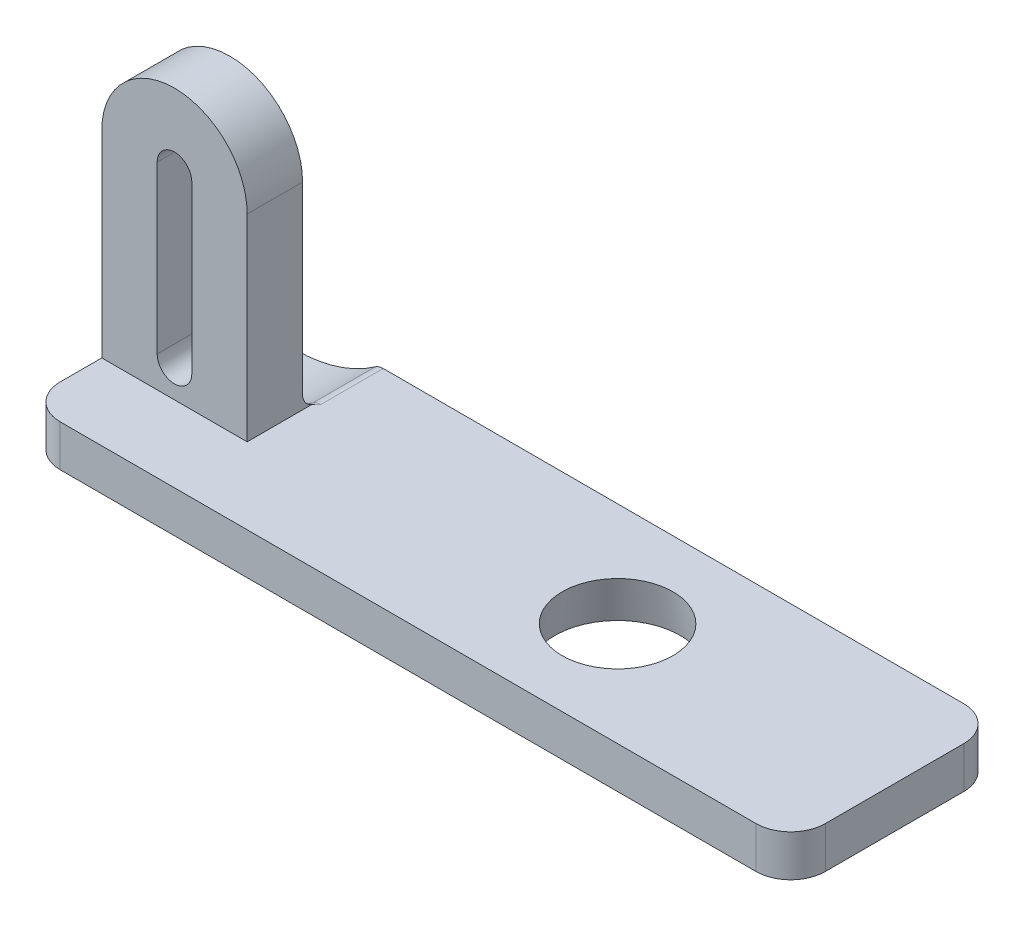
ISO-10303-21;
HEADER;
FILE_DESCRIPTION(('STEP AP214'),'2;1');
FILE_NAME('part.step','',(''),(''),'','','');
FILE_SCHEMA(('AUTOMOTIVE_DESIGN { 1 0 10303 214 1 1 1 1 }'));
ENDSEC;
DATA;
#1=APPLICATION_CONTEXT('core data for automotive mechanical design processes');
#2=APPLICATION_PROTOCOL_DEFINITION('international standard','automotive_design',2000,#1);
#3=PRODUCT_CONTEXT('',#1,'mechanical');
#4=PRODUCT('Part','Part','',(#3));
#5=PRODUCT_RELATED_PRODUCT_CATEGORY('part','',(#4));
#6=PRODUCT_DEFINITION_FORMATION('','',#4);
#7=PRODUCT_DEFINITION_CONTEXT('part definition',#1,'design');
#8=PRODUCT_DEFINITION('design','',#6,#7);
#9=PRODUCT_DEFINITION_SHAPE('','',#8);
#10=(LENGTH_UNIT() NAMED_UNIT(*) SI_UNIT(.MILLI.,.METRE.));
#11=(NAMED_UNIT(*) PLANE_ANGLE_UNIT() SI_UNIT($,.RADIAN.));
#12=(NAMED_UNIT(*) SI_UNIT($,.STERADIAN.) SOLID_ANGLE_UNIT());
#13=UNCERTAINTY_MEASURE_WITH_UNIT(LENGTH_MEASURE(1.E-05),#10,'distance_accuracy_value','');
#14=(GEOMETRIC_REPRESENTATION_CONTEXT(3) GLOBAL_UNCERTAINTY_ASSIGNED_CONTEXT((#13)) GLOBAL_UNIT_ASSIGNED_CONTEXT((#10,
#11,#12)) REPRESENTATION_CONTEXT('',''));
#15=CARTESIAN_POINT('',(0.,0.,0.));
#16=DIRECTION('',(0.,0.,1.));
#17=DIRECTION('',(1.,0.,0.));
#18=AXIS2_PLACEMENT_3D('',#15,#16,#17);
#19=CARTESIAN_POINT('',(-2.75,12.,-5.));
#20=DIRECTION('',(0.,1.,0.));
#21=DIRECTION('',(0.,0.,1.));
#22=AXIS2_PLACEMENT_3D('',#19,#20,#21);
#23=CYLINDRICAL_SURFACE('',#22,2.5);
#24=DIRECTION('',(0.,-1.,0.));
#25=VECTOR('',#24,1.);
#26=CARTESIAN_POINT('',(-5.25,-5.25,-5.));
#27=LINE('',#26,#25);
#28=CARTESIAN_POINT('',(-5.25,-4.25,-5.));
#29=VERTEX_POINT('',#28);
#30=CARTESIAN_POINT('',(-5.25,-5.25,-5.));
#31=VERTEX_POINT('',#30);
#32=EDGE_CURVE('E197',#29,#31,#27,.T.);
#33=ORIENTED_EDGE('',*,*,#32,.F.);
#34=CARTESIAN_POINT('',(-2.75,-4.25,-5.));
#35=DIRECTION('',(0.,1.,0.));
#36=DIRECTION('',(0.,0.,1.));
#37=AXIS2_PLACEMENT_3D('',#34,#35,#36);
#38=CIRCLE('',#37,2.5);
#39=CARTESIAN_POINT('',(-2.75,-4.25,-7.5));
#40=VERTEX_POINT('',#39);
#41=EDGE_CURVE('E184',#40,#29,#38,.T.);
#42=ORIENTED_EDGE('',*,*,#41,.F.);
#43=DIRECTION('',(0.,-1.,0.));
#44=VECTOR('',#43,1.);
#45=CARTESIAN_POINT('',(-2.75,-2.25,-7.5));
#46=LINE('',#45,#44);
#47=CARTESIAN_POINT('',(-2.75,-5.25,-7.5));
#48=VERTEX_POINT('',#47);
#49=EDGE_CURVE('E218',#48,#40,#46,.F.);
#50=ORIENTED_EDGE('',*,*,#49,.F.);
#51=CARTESIAN_POINT('',(-2.75,-5.25,-5.));
#52=DIRECTION('',(0.,1.,0.));
#53=DIRECTION('',(0.,0.,1.));
#54=AXIS2_PLACEMENT_3D('',#51,#52,#53);
#55=CIRCLE('',#54,2.5);
#56=EDGE_CURVE('E201',#31,#48,#55,.F.);
#57=ORIENTED_EDGE('',*,*,#56,.F.);
#58=EDGE_LOOP('',(#33,#42,#50,#57));
#59=FACE_BOUND('',#58,.T.);
#60=ADVANCED_FACE('F39',(#59),#23,.T.);
#61=CARTESIAN_POINT('',(0.,12.,7.5));
#62=DIRECTION('',(0.,0.,-1.));
#63=DIRECTION('',(-1.,0.,0.));
#64=AXIS2_PLACEMENT_3D('',#61,#62,#63);
#65=CYLINDRICAL_SURFACE('',#64,5.25);
#66=DIRECTION('',(0.,0.,-1.));
#67=VECTOR('',#66,1.);
#68=CARTESIAN_POINT('',(5.25,12.,7.5));
#69=LINE('',#68,#67);
#70=CARTESIAN_POINT('',(5.25,12.,2.));
#71=VERTEX_POINT('',#70);
#72=CARTESIAN_POINT('',(5.25,12.,-2.));
#73=VERTEX_POINT('',#72);
#74=EDGE_CURVE('E406',#71,#73,#69,.T.);
#75=ORIENTED_EDGE('',*,*,#74,.T.);
#76=CARTESIAN_POINT('',(0.,12.,-2.));
#77=DIRECTION('',(0.,0.,1.));
#78=DIRECTION('',(1.,0.,0.));
#79=AXIS2_PLACEMENT_3D('',#76,#77,#78);
#80=CIRCLE('',#79,5.25);
#81=CARTESIAN_POINT('',(-5.25,12.,-2.));
#82=VERTEX_POINT('',#81);
#83=EDGE_CURVE('E349',#82,#73,#80,.F.);
#84=ORIENTED_EDGE('',*,*,#83,.F.);
#85=DIRECTION('',(0.,0.,-1.));
#86=VECTOR('',#85,1.);
#87=CARTESIAN_POINT('',(-5.25,12.,7.5));
#88=LINE('',#87,#86);
#89=CARTESIAN_POINT('',(-5.25,12.,2.));
#90=VERTEX_POINT('',#89);
#91=EDGE_CURVE('E422',#90,#82,#88,.T.);
#92=ORIENTED_EDGE('',*,*,#91,.F.);
#93=CARTESIAN_POINT('',(0.,12.,2.));
#94=DIRECTION('',(0.,0.,1.));
#95=DIRECTION('',(1.,0.,0.));
#96=AXIS2_PLACEMENT_3D('',#93,#94,#95);
#97=CIRCLE('',#96,5.25);
#98=EDGE_CURVE('E369',#90,#71,#97,.F.);
#99=ORIENTED_EDGE('',*,*,#98,.T.);
#100=EDGE_LOOP('',(#75,#84,#92,#99));
#101=FACE_BOUND('',#100,.T.);
#102=ADVANCED_FACE('F296',(#101),#65,.T.);
#103=CARTESIAN_POINT('',(5.25,12.,7.5));
#104=DIRECTION('',(-1.,0.,0.));
#105=DIRECTION('',(0.,-1.,0.));
#106=AXIS2_PLACEMENT_3D('',#103,#104,#105);
#107=PLANE('',#106);
#108=DIRECTION('',(0.,0.,-1.));
#109=VECTOR('',#108,1.);
#110=CARTESIAN_POINT('',(5.25,-2.25,7.5));
#111=LINE('',#110,#109);
#112=CARTESIAN_POINT('',(5.25,-2.25,2.));
#113=VERTEX_POINT('',#112);
#114=CARTESIAN_POINT('',(5.25,-2.25,-2.68367330800403));
#115=VERTEX_POINT('',#114);
#116=EDGE_CURVE('E56',#113,#115,#111,.T.);
#117=ORIENTED_EDGE('',*,*,#116,.T.);
#118=CARTESIAN_POINT('',(5.25,-2.25,-2.68367330800403));
#119=CARTESIAN_POINT('',(5.25,-2.23117446991627,-2.62986567113826));
#120=CARTESIAN_POINT('',(5.25,-2.20758815592801,-2.57779088870811));
#121=CARTESIAN_POINT('',(5.25,-2.15200212125329,-2.47845496380608));
#122=CARTESIAN_POINT('',(5.25,-2.12001736194642,-2.43118546664869));
#123=CARTESIAN_POINT('',(5.25,-2.04869554314345,-2.34264234624726));
#124=CARTESIAN_POINT('',(5.25,-2.00936408325374,-2.3013641987378));
#125=CARTESIAN_POINT('',(5.25,-1.92447906424598,-2.22576847736665));
#126=CARTESIAN_POINT('',(5.25,-1.87892320484554,-2.19145348850816));
#127=CARTESIAN_POINT('',(5.25,-1.78158856659626,-2.1298977295296));
#128=CARTESIAN_POINT('',(5.25,-1.729678796793,-2.10286406490579));
#129=CARTESIAN_POINT('',(5.25,-1.62208066712606,-2.05786179627178));
#130=CARTESIAN_POINT('',(5.25,-1.56639438993115,-2.03988824117758));
#131=CARTESIAN_POINT('',(5.25,-1.4714157237039,-2.01785681894849));
#132=CARTESIAN_POINT('',(5.25,-1.43271316817472,-2.01117083172378));
#133=CARTESIAN_POINT('',(5.25,-1.35484978892017,-2.00224241638915));
#134=CARTESIAN_POINT('',(5.25,-1.31568961769241,-1.99999429159705));
#135=CARTESIAN_POINT('',(5.25,-1.27650973044174,-2.));
#136=B_SPLINE_CURVE_WITH_KNOTS('',3,(#118,#119,#120,#121,#122,#123,#124,#125,#126,#127,#128,
#129,#130,#131,#132,#133,#134,#135),.UNSPECIFIED.,.F.,.F.,(4,2,2,2,2,2,2,2,4),(0.,
0.170709651517211,0.341117232213087,0.511395455486113,0.681736777665116,0.856506568036482,
1.03118074802568,1.14877001093018,1.26620823143617),.UNSPECIFIED.);
#137=CARTESIAN_POINT('',(5.25,-1.27650973044175,-2.));
#138=VERTEX_POINT('',#137);
#139=EDGE_CURVE('E48',#115,#138,#136,.T.);
#140=ORIENTED_EDGE('',*,*,#139,.T.);
#141=DIRECTION('',(0.,-1.,0.));
#142=VECTOR('',#141,1.);
#143=CARTESIAN_POINT('',(5.25,12.,-2.));
#144=LINE('',#143,#142);
#145=EDGE_CURVE('E351',#73,#138,#144,.T.);
#146=ORIENTED_EDGE('',*,*,#145,.F.);
#147=ORIENTED_EDGE('',*,*,#74,.F.);
#148=DIRECTION('',(0.,-1.,0.));
#149=VECTOR('',#148,1.);
#150=CARTESIAN_POINT('',(5.25,-2.25,2.));
#151=LINE('',#150,#149);
#152=EDGE_CURVE('E367',#71,#113,#151,.T.);
#153=ORIENTED_EDGE('',*,*,#152,.T.);
#154=EDGE_LOOP('',(#117,#140,#146,#147,#153));
#155=FACE_BOUND('',#154,.T.);
#156=ADVANCED_FACE('F283',(#155),#107,.F.);
#157=CARTESIAN_POINT('',(0.,12.,7.5));
#158=DIRECTION('',(0.,0.,-1.));
#159=DIRECTION('',(-1.,0.,0.));
#160=AXIS2_PLACEMENT_3D('',#157,#158,#159);
#161=CYLINDRICAL_SURFACE('',#160,1.25);
#162=CARTESIAN_POINT('',(0.,12.,-2.));
#163=DIRECTION('',(0.,0.,1.));
#164=DIRECTION('',(1.,0.,0.));
#165=AXIS2_PLACEMENT_3D('',#162,#163,#164);
#166=CIRCLE('',#165,1.25);
#167=CARTESIAN_POINT('',(1.25,12.,-2.));
#168=VERTEX_POINT('',#167);
#169=CARTESIAN_POINT('',(-1.25,12.,-2.));
#170=VERTEX_POINT('',#169);
#171=EDGE_CURVE('E362',#168,#170,#166,.T.);
#172=ORIENTED_EDGE('',*,*,#171,.F.);
#173=DIRECTION('',(0.,0.,-1.));
#174=VECTOR('',#173,1.);
#175=CARTESIAN_POINT('',(1.25,12.,7.5));
#176=LINE('',#175,#174);
#177=CARTESIAN_POINT('',(1.25,12.,2.));
#178=VERTEX_POINT('',#177);
#179=EDGE_CURVE('E386',#178,#168,#176,.T.);
#180=ORIENTED_EDGE('',*,*,#179,.F.);
#181=CARTESIAN_POINT('',(0.,12.,2.));
#182=DIRECTION('',(0.,0.,1.));
#183=DIRECTION('',(1.,0.,0.));
#184=AXIS2_PLACEMENT_3D('',#181,#182,#183);
#185=CIRCLE('',#184,1.25);
#186=CARTESIAN_POINT('',(-1.25,12.,2.));
#187=VERTEX_POINT('',#186);
#188=EDGE_CURVE('E383',#178,#187,#185,.T.);
#189=ORIENTED_EDGE('',*,*,#188,.T.);
#190=DIRECTION('',(0.,0.,-1.));
#191=VECTOR('',#190,1.);
#192=CARTESIAN_POINT('',(-1.25,12.,7.5));
#193=LINE('',#192,#191);
#194=EDGE_CURVE('E395',#187,#170,#193,.T.);
#195=ORIENTED_EDGE('',*,*,#194,.T.);
#196=EDGE_LOOP('',(#172,#180,#189,#195));
#197=FACE_BOUND('',#196,.T.);
#198=ADVANCED_FACE('F433',(#197),#161,.F.);
#199=CARTESIAN_POINT('',(-1.25,12.,7.5));
#200=DIRECTION('',(1.,0.,0.));
#201=DIRECTION('',(0.,1.,0.));
#202=AXIS2_PLACEMENT_3D('',#199,#200,#201);
#203=PLANE('',#202);
#204=DIRECTION('',(0.,-1.,0.));
#205=VECTOR('',#204,1.);
#206=CARTESIAN_POINT('',(-1.25,12.,-2.));
#207=LINE('',#206,#205);
#208=CARTESIAN_POINT('',(-1.25,0.,-2.));
#209=VERTEX_POINT('',#208);
#210=EDGE_CURVE('E360',#170,#209,#207,.T.);
#211=ORIENTED_EDGE('',*,*,#210,.F.);
#212=ORIENTED_EDGE('',*,*,#194,.F.);
#213=DIRECTION('',(0.,-1.,0.));
#214=VECTOR('',#213,1.);
#215=CARTESIAN_POINT('',(-1.25,12.,2.));
#216=LINE('',#215,#214);
#217=CARTESIAN_POINT('',(-1.25,0.,2.));
#218=VERTEX_POINT('',#217);
#219=EDGE_CURVE('E380',#187,#218,#216,.T.);
#220=ORIENTED_EDGE('',*,*,#219,.T.);
#221=DIRECTION('',(0.,0.,-1.));
#222=VECTOR('',#221,1.);
#223=CARTESIAN_POINT('',(-1.25,0.,7.5));
#224=LINE('',#223,#222);
#225=EDGE_CURVE('E392',#218,#209,#224,.T.);
#226=ORIENTED_EDGE('',*,*,#225,.T.);
#227=EDGE_LOOP('',(#211,#212,#220,#226));
#228=FACE_BOUND('',#227,.T.);
#229=ADVANCED_FACE('F441',(#228),#203,.T.);
#230=CARTESIAN_POINT('',(0.,0.,7.5));
#231=DIRECTION('',(0.,0.,-1.));
#232=DIRECTION('',(-1.,0.,0.));
#233=AXIS2_PLACEMENT_3D('',#230,#231,#232);
#234=CYLINDRICAL_SURFACE('',#233,1.25);
#235=CARTESIAN_POINT('',(0.,0.,-2.));
#236=DIRECTION('',(0.,0.,1.));
#237=DIRECTION('',(1.,0.,0.));
#238=AXIS2_PLACEMENT_3D('',#235,#236,#237);
#239=CIRCLE('',#238,1.25);
#240=CARTESIAN_POINT('',(1.25,0.,-2.));
#241=VERTEX_POINT('',#240);
#242=EDGE_CURVE('E358',#209,#241,#239,.T.);
#243=ORIENTED_EDGE('',*,*,#242,.F.);
#244=ORIENTED_EDGE('',*,*,#225,.F.);
#245=CARTESIAN_POINT('',(0.,0.,2.));
#246=DIRECTION('',(0.,0.,1.));
#247=DIRECTION('',(1.,0.,0.));
#248=AXIS2_PLACEMENT_3D('',#245,#246,#247);
#249=CIRCLE('',#248,1.25);
#250=CARTESIAN_POINT('',(1.25,0.,2.));
#251=VERTEX_POINT('',#250);
#252=EDGE_CURVE('E377',#218,#251,#249,.T.);
#253=ORIENTED_EDGE('',*,*,#252,.T.);
#254=DIRECTION('',(0.,0.,-1.));
#255=VECTOR('',#254,1.);
#256=CARTESIAN_POINT('',(1.25,0.,7.5));
#257=LINE('',#256,#255);
#258=EDGE_CURVE('E389',#251,#241,#257,.T.);
#259=ORIENTED_EDGE('',*,*,#258,.T.);
#260=EDGE_LOOP('',(#243,#244,#253,#259));
#261=FACE_BOUND('',#260,.T.);
#262=ADVANCED_FACE('F444',(#261),#234,.F.);
#263=CARTESIAN_POINT('',(1.25,12.,7.5));
#264=DIRECTION('',(-1.,0.,0.));
#265=DIRECTION('',(0.,-1.,0.));
#266=AXIS2_PLACEMENT_3D('',#263,#264,#265);
#267=PLANE('',#266);
#268=DIRECTION('',(0.,1.,0.));
#269=VECTOR('',#268,1.);
#270=CARTESIAN_POINT('',(1.25,12.,-2.));
#271=LINE('',#270,#269);
#272=EDGE_CURVE('E354',#241,#168,#271,.T.);
#273=ORIENTED_EDGE('',*,*,#272,.F.);
#274=ORIENTED_EDGE('',*,*,#258,.F.);
#275=DIRECTION('',(0.,1.,0.));
#276=VECTOR('',#275,1.);
#277=CARTESIAN_POINT('',(1.25,12.,2.));
#278=LINE('',#277,#276);
#279=EDGE_CURVE('E208',#251,#178,#278,.T.);
#280=ORIENTED_EDGE('',*,*,#279,.T.);
#281=ORIENTED_EDGE('',*,*,#179,.T.);
#282=EDGE_LOOP('',(#273,#274,#280,#281));
#283=FACE_BOUND('',#282,.T.);
#284=ADVANCED_FACE('F429',(#283),#267,.T.);
#285=CARTESIAN_POINT('',(0.,12.,7.5));
#286=DIRECTION('',(0.,0.,-1.));
#287=DIRECTION('',(-1.,0.,0.));
#288=AXIS2_PLACEMENT_3D('',#285,#286,#287);
#289=PLANE('',#288);
#290=DIRECTION('',(1.,0.,0.));
#291=VECTOR('',#290,1.);
#292=CARTESIAN_POINT('',(-5.25,-5.25,7.5));
#293=LINE('',#292,#291);
#294=CARTESIAN_POINT('',(-2.75,-5.25,7.5));
#295=VERTEX_POINT('',#294);
#296=CARTESIAN_POINT('',(47.5,-5.25,7.5));
#297=VERTEX_POINT('',#296);
#298=EDGE_CURVE('E399',#295,#297,#293,.T.);
#299=ORIENTED_EDGE('',*,*,#298,.T.);
#300=DIRECTION('',(0.,1.,0.));
#301=VECTOR('',#300,1.);
#302=CARTESIAN_POINT('',(47.5,12.,7.5));
#303=LINE('',#302,#301);
#304=CARTESIAN_POINT('',(47.5,-2.25,7.5));
#305=VERTEX_POINT('',#304);
#306=EDGE_CURVE('E234',#297,#305,#303,.T.);
#307=ORIENTED_EDGE('',*,*,#306,.T.);
#308=DIRECTION('',(-1.,0.,0.));
#309=VECTOR('',#308,1.);
#310=CARTESIAN_POINT('',(5.25,-2.25,7.5));
#311=LINE('',#310,#309);
#312=CARTESIAN_POINT('',(-2.75,-2.25,7.5));
#313=VERTEX_POINT('',#312);
#314=EDGE_CURVE('E402',#305,#313,#311,.T.);
#315=ORIENTED_EDGE('',*,*,#314,.T.);
#316=DIRECTION('',(0.,-1.,0.));
#317=VECTOR('',#316,1.);
#318=CARTESIAN_POINT('',(-2.75,12.,7.5));
#319=LINE('',#318,#317);
#320=EDGE_CURVE('E231',#313,#295,#319,.T.);
#321=ORIENTED_EDGE('',*,*,#320,.T.);
#322=EDGE_LOOP('',(#299,#307,#315,#321));
#323=FACE_BOUND('',#322,.T.);
#324=ADVANCED_FACE('F471',(#323),#289,.F.);
#325=CARTESIAN_POINT('',(0.,12.,-7.5));
#326=DIRECTION('',(0.,0.,-1.));
#327=DIRECTION('',(-1.,0.,0.));
#328=AXIS2_PLACEMENT_3D('',#325,#326,#327);
#329=PLANE('',#328);
#330=CARTESIAN_POINT('',(-0.749999999999998,5.75,-7.5));
#331=DIRECTION('',(0.,0.,-1.));
#332=DIRECTION('',(-1.,0.,0.));
#333=AXIS2_PLACEMENT_3D('',#330,#331,#332);
#334=CIRCLE('',#333,10.);
#335=CARTESIAN_POINT('',(-0.749999999999998,-4.25,-7.5));
#336=VERTEX_POINT('',#335);
#337=CARTESIAN_POINT('',(4.99959574576069,-2.43181818181818,-7.5));
#338=VERTEX_POINT('',#337);
#339=EDGE_CURVE('E239',#336,#338,#334,.F.);
#340=ORIENTED_EDGE('',*,*,#339,.T.);
#341=CARTESIAN_POINT('',(5.57455532033676,-3.25,-7.5));
#342=DIRECTION('',(0.,0.,-1.));
#343=DIRECTION('',(-1.,0.,0.));
#344=AXIS2_PLACEMENT_3D('',#341,#342,#343);
#345=CIRCLE('',#344,1.);
#346=CARTESIAN_POINT('',(5.57455532033676,-2.25,-7.5));
#347=VERTEX_POINT('',#346);
#348=EDGE_CURVE('E244',#338,#347,#345,.T.);
#349=ORIENTED_EDGE('',*,*,#348,.T.);
#350=DIRECTION('',(-1.,0.,0.));
#351=VECTOR('',#350,1.);
#352=CARTESIAN_POINT('',(5.25,-2.25,-7.5));
#353=LINE('',#352,#351);
#354=CARTESIAN_POINT('',(47.5,-2.25,-7.5));
#355=VERTEX_POINT('',#354);
#356=EDGE_CURVE('E403',#355,#347,#353,.T.);
#357=ORIENTED_EDGE('',*,*,#356,.F.);
#358=DIRECTION('',(0.,1.,0.));
#359=VECTOR('',#358,1.);
#360=CARTESIAN_POINT('',(47.5,-5.25,-7.5));
#361=LINE('',#360,#359);
#362=CARTESIAN_POINT('',(47.5,-5.25,-7.5));
#363=VERTEX_POINT('',#362);
#364=EDGE_CURVE('E216',#355,#363,#361,.F.);
#365=ORIENTED_EDGE('',*,*,#364,.T.);
#366=DIRECTION('',(1.,0.,0.));
#367=VECTOR('',#366,1.);
#368=CARTESIAN_POINT('',(-5.25,-5.25,-7.5));
#369=LINE('',#368,#367);
#370=EDGE_CURVE('E398',#48,#363,#369,.T.);
#371=ORIENTED_EDGE('',*,*,#370,.F.);
#372=ORIENTED_EDGE('',*,*,#49,.T.);
#373=DIRECTION('',(-1.,0.,0.));
#374=VECTOR('',#373,1.);
#375=CARTESIAN_POINT('',(5.25,-4.25,-7.5));
#376=LINE('',#375,#374);
#377=EDGE_CURVE('E189',#336,#40,#376,.T.);
#378=ORIENTED_EDGE('',*,*,#377,.F.);
#379=EDGE_LOOP('',(#340,#349,#357,#365,#371,#372,#378));
#380=FACE_BOUND('',#379,.T.);
#381=ADVANCED_FACE('F295',(#380),#329,.T.);
#382=CARTESIAN_POINT('',(-5.25,12.,7.5));
#383=DIRECTION('',(1.,0.,0.));
#384=DIRECTION('',(0.,0.,-1.));
#385=AXIS2_PLACEMENT_3D('',#382,#383,#384);
#386=PLANE('',#385);
#387=DIRECTION('',(0.,1.,0.));
#388=VECTOR('',#387,1.);
#389=CARTESIAN_POINT('',(-5.25,12.,-2.));
#390=LINE('',#389,#388);
#391=CARTESIAN_POINT('',(-5.25,-3.25,-2.));
#392=VERTEX_POINT('',#391);
#393=EDGE_CURVE('E352',#392,#82,#390,.T.);
#394=ORIENTED_EDGE('',*,*,#393,.F.);
#395=CARTESIAN_POINT('',(-5.25,-3.25,-3.));
#396=DIRECTION('',(1.,0.,0.));
#397=DIRECTION('',(0.,0.,-1.));
#398=AXIS2_PLACEMENT_3D('',#395,#396,#397);
#399=CIRCLE('',#398,1.);
#400=CARTESIAN_POINT('',(-5.25,-4.25,-3.));
#401=VERTEX_POINT('',#400);
#402=EDGE_CURVE('E12',#392,#401,#399,.T.);
#403=ORIENTED_EDGE('',*,*,#402,.T.);
#404=DIRECTION('',(0.,0.,1.));
#405=VECTOR('',#404,1.);
#406=CARTESIAN_POINT('',(-5.25,-4.25,-2.));
#407=LINE('',#406,#405);
#408=EDGE_CURVE('E186',#29,#401,#407,.T.);
#409=ORIENTED_EDGE('',*,*,#408,.F.);
#410=ORIENTED_EDGE('',*,*,#32,.T.);
#411=DIRECTION('',(0.,0.,-1.));
#412=VECTOR('',#411,1.);
#413=CARTESIAN_POINT('',(-5.25,-5.25,7.5));
#414=LINE('',#413,#412);
#415=CARTESIAN_POINT('',(-5.25,-5.25,5.));
#416=VERTEX_POINT('',#415);
#417=EDGE_CURVE('E420',#416,#31,#414,.T.);
#418=ORIENTED_EDGE('',*,*,#417,.F.);
#419=DIRECTION('',(0.,-1.,0.));
#420=VECTOR('',#419,1.);
#421=CARTESIAN_POINT('',(-5.25,12.,5.));
#422=LINE('',#421,#420);
#423=CARTESIAN_POINT('',(-5.25,-2.25,5.));
#424=VERTEX_POINT('',#423);
#425=EDGE_CURVE('E204',#416,#424,#422,.F.);
#426=ORIENTED_EDGE('',*,*,#425,.T.);
#427=DIRECTION('',(0.,0.,1.));
#428=VECTOR('',#427,1.);
#429=CARTESIAN_POINT('',(-5.25,-2.25,-22.1472345903501));
#430=LINE('',#429,#428);
#431=CARTESIAN_POINT('',(-5.25,-2.25,2.));
#432=VERTEX_POINT('',#431);
#433=EDGE_CURVE('E364',#432,#424,#430,.T.);
#434=ORIENTED_EDGE('',*,*,#433,.F.);
#435=DIRECTION('',(0.,1.,0.));
#436=VECTOR('',#435,1.);
#437=CARTESIAN_POINT('',(-5.25,12.,2.));
#438=LINE('',#437,#436);
#439=EDGE_CURVE('E372',#432,#90,#438,.T.);
#440=ORIENTED_EDGE('',*,*,#439,.T.);
#441=ORIENTED_EDGE('',*,*,#91,.T.);
#442=EDGE_LOOP('',(#394,#403,#409,#410,#418,#426,#434,#440,#441));
#443=FACE_BOUND('',#442,.T.);
#444=ADVANCED_FACE('F195',(#443),#386,.F.);
#445=CARTESIAN_POINT('',(-5.25,-5.25,7.5));
#446=DIRECTION('',(0.,1.,0.));
#447=DIRECTION('',(0.,0.,1.));
#448=AXIS2_PLACEMENT_3D('',#445,#446,#447);
#449=PLANE('',#448);
#450=CARTESIAN_POINT('',(30.,-5.25,0.));
#451=DIRECTION('',(0.,1.,0.));
#452=DIRECTION('',(0.,0.,1.));
#453=AXIS2_PLACEMENT_3D('',#450,#451,#452);
#454=CIRCLE('',#453,4.5289809421254);
#455=CARTESIAN_POINT('',(30.,-5.25,4.5289809421254));
#456=VERTEX_POINT('',#455);
#457=EDGE_CURVE('E346',#456,#456,#454,.T.);
#458=ORIENTED_EDGE('',*,*,#457,.T.);
#459=EDGE_LOOP('',(#458));
#460=FACE_BOUND('',#459,.T.);
#461=ORIENTED_EDGE('',*,*,#417,.T.);
#462=ORIENTED_EDGE('',*,*,#56,.T.);
#463=ORIENTED_EDGE('',*,*,#370,.T.);
#464=CARTESIAN_POINT('',(47.5,-5.25,-5.));
#465=DIRECTION('',(0.,1.,0.));
#466=DIRECTION('',(0.,0.,1.));
#467=AXIS2_PLACEMENT_3D('',#464,#465,#466);
#468=CIRCLE('',#467,2.5);
#469=CARTESIAN_POINT('',(50.,-5.25,-5.));
#470=VERTEX_POINT('',#469);
#471=EDGE_CURVE('E213',#363,#470,#468,.F.);
#472=ORIENTED_EDGE('',*,*,#471,.T.);
#473=DIRECTION('',(0.,0.,-1.));
#474=VECTOR('',#473,1.);
#475=CARTESIAN_POINT('',(50.,-5.25,7.5));
#476=LINE('',#475,#474);
#477=CARTESIAN_POINT('',(50.,-5.25,5.));
#478=VERTEX_POINT('',#477);
#479=EDGE_CURVE('E417',#478,#470,#476,.T.);
#480=ORIENTED_EDGE('',*,*,#479,.F.);
#481=CARTESIAN_POINT('',(47.5,-5.25,5.));
#482=DIRECTION('',(0.,1.,0.));
#483=DIRECTION('',(0.,0.,1.));
#484=AXIS2_PLACEMENT_3D('',#481,#482,#483);
#485=CIRCLE('',#484,2.5);
#486=EDGE_CURVE('E206',#478,#297,#485,.F.);
#487=ORIENTED_EDGE('',*,*,#486,.T.);
#488=ORIENTED_EDGE('',*,*,#298,.F.);
#489=CARTESIAN_POINT('',(-2.75,-5.25,5.));
#490=DIRECTION('',(0.,1.,0.));
#491=DIRECTION('',(0.,0.,1.));
#492=AXIS2_PLACEMENT_3D('',#489,#490,#491);
#493=CIRCLE('',#492,2.5);
#494=EDGE_CURVE('E203',#295,#416,#493,.F.);
#495=ORIENTED_EDGE('',*,*,#494,.T.);
#496=EDGE_LOOP('',(#461,#462,#463,#472,#480,#487,#488,#495));
#497=FACE_BOUND('',#496,.T.);
#498=ADVANCED_FACE('F288',(#460,#497),#449,.F.);
#499=CARTESIAN_POINT('',(50.,-2.25,7.5));
#500=DIRECTION('',(-1.,0.,0.));
#501=DIRECTION('',(0.,0.,1.));
#502=AXIS2_PLACEMENT_3D('',#499,#500,#501);
#503=PLANE('',#502);
#504=ORIENTED_EDGE('',*,*,#479,.T.);
#505=DIRECTION('',(0.,1.,0.));
#506=VECTOR('',#505,1.);
#507=CARTESIAN_POINT('',(50.,-2.25,-5.));
#508=LINE('',#507,#506);
#509=CARTESIAN_POINT('',(50.,-2.25,-5.));
#510=VERTEX_POINT('',#509);
#511=EDGE_CURVE('E228',#470,#510,#508,.T.);
#512=ORIENTED_EDGE('',*,*,#511,.T.);
#513=DIRECTION('',(0.,0.,-1.));
#514=VECTOR('',#513,1.);
#515=CARTESIAN_POINT('',(50.,-2.25,7.5));
#516=LINE('',#515,#514);
#517=CARTESIAN_POINT('',(50.,-2.25,5.));
#518=VERTEX_POINT('',#517);
#519=EDGE_CURVE('E414',#518,#510,#516,.T.);
#520=ORIENTED_EDGE('',*,*,#519,.F.);
#521=DIRECTION('',(0.,1.,0.));
#522=VECTOR('',#521,1.);
#523=CARTESIAN_POINT('',(50.,-2.25,5.));
#524=LINE('',#523,#522);
#525=EDGE_CURVE('E226',#518,#478,#524,.F.);
#526=ORIENTED_EDGE('',*,*,#525,.T.);
#527=EDGE_LOOP('',(#504,#512,#520,#526));
#528=FACE_BOUND('',#527,.T.);
#529=ADVANCED_FACE('F281',(#528),#503,.F.);
#530=CARTESIAN_POINT('',(5.25,-2.25,7.5));
#531=DIRECTION('',(0.,-1.,0.));
#532=DIRECTION('',(0.,0.,-1.));
#533=AXIS2_PLACEMENT_3D('',#530,#531,#532);
#534=PLANE('',#533);
#535=CARTESIAN_POINT('',(30.,-2.25,0.));
#536=DIRECTION('',(0.,1.,0.));
#537=DIRECTION('',(0.,0.,1.));
#538=AXIS2_PLACEMENT_3D('',#535,#536,#537);
#539=CIRCLE('',#538,4.00000000000001);
#540=CARTESIAN_POINT('',(30.,-2.25,4.00000000000001));
#541=VERTEX_POINT('',#540);
#542=EDGE_CURVE('E199',#541,#541,#539,.T.);
#543=ORIENTED_EDGE('',*,*,#542,.F.);
#544=EDGE_LOOP('',(#543));
#545=FACE_BOUND('',#544,.T.);
#546=ORIENTED_EDGE('',*,*,#356,.T.);
#547=DIRECTION('',(0.,0.,-1.));
#548=VECTOR('',#547,1.);
#549=CARTESIAN_POINT('',(5.57455532033676,-2.25,7.5));
#550=LINE('',#549,#548);
#551=CARTESIAN_POINT('',(5.57455532033676,-2.25,-3.));
#552=VERTEX_POINT('',#551);
#553=EDGE_CURVE('E246',#347,#552,#550,.F.);
#554=ORIENTED_EDGE('',*,*,#553,.T.);
#555=CARTESIAN_POINT('',(5.25,-2.25,-2.68367330800403));
#556=CARTESIAN_POINT('',(5.30467382771404,-2.24999999999999,-2.73429007344327));
#557=CARTESIAN_POINT('',(5.35836343553421,-2.24999999999999,-2.78592292147372));
#558=CARTESIAN_POINT('',(5.46473523839905,-2.25000000000001,-2.8902094724383));
#559=CARTESIAN_POINT('',(5.51741755662603,-2.25000000000002,-2.94286304894004));
#560=CARTESIAN_POINT('',(5.57157389866178,-2.25,-2.99701857824215));
#561=CARTESIAN_POINT('',(5.57306461070622,-2.25,-2.99850929030965));
#562=CARTESIAN_POINT('',(5.57455532033676,-2.25,-3.));
#563=B_SPLINE_CURVE_WITH_KNOTS('',3,(#555,#556,#557,#558,#559,#560,#561,#562),.UNSPECIFIED.,.F.,
.F.,(4,2,2,4),(0.,0.223466778332691,0.446906051639364,0.453230606961699),.UNSPECIFIED.);
#564=EDGE_CURVE('E262',#552,#115,#563,.F.);
#565=ORIENTED_EDGE('',*,*,#564,.T.);
#566=ORIENTED_EDGE('',*,*,#116,.F.);
#567=DIRECTION('',(-1.,0.,0.));
#568=VECTOR('',#567,1.);
#569=CARTESIAN_POINT('',(5.25,-2.25,2.));
#570=LINE('',#569,#568);
#571=EDGE_CURVE('E365',#113,#432,#570,.T.);
#572=ORIENTED_EDGE('',*,*,#571,.T.);
#573=ORIENTED_EDGE('',*,*,#433,.T.);
#574=CARTESIAN_POINT('',(-2.75,-2.25,5.));
#575=DIRECTION('',(0.,-1.,0.));
#576=DIRECTION('',(0.,0.,-1.));
#577=AXIS2_PLACEMENT_3D('',#574,#575,#576);
#578=CIRCLE('',#577,2.5);
#579=EDGE_CURVE('E220',#424,#313,#578,.F.);
#580=ORIENTED_EDGE('',*,*,#579,.T.);
#581=ORIENTED_EDGE('',*,*,#314,.F.);
#582=CARTESIAN_POINT('',(47.5,-2.25,5.));
#583=DIRECTION('',(0.,-1.,0.));
#584=DIRECTION('',(0.,0.,-1.));
#585=AXIS2_PLACEMENT_3D('',#582,#583,#584);
#586=CIRCLE('',#585,2.5);
#587=EDGE_CURVE('E222',#305,#518,#586,.F.);
#588=ORIENTED_EDGE('',*,*,#587,.T.);
#589=ORIENTED_EDGE('',*,*,#519,.T.);
#590=CARTESIAN_POINT('',(47.5,-2.25,-5.));
#591=DIRECTION('',(0.,-1.,0.));
#592=DIRECTION('',(0.,0.,-1.));
#593=AXIS2_PLACEMENT_3D('',#590,#591,#592);
#594=CIRCLE('',#593,2.5);
#595=EDGE_CURVE('E224',#510,#355,#594,.F.);
#596=ORIENTED_EDGE('',*,*,#595,.T.);
#597=EDGE_LOOP('',(#546,#554,#565,#566,#572,#573,#580,#581,#588,#589,#596));
#598=FACE_BOUND('',#597,.T.);
#599=ADVANCED_FACE('F276',(#545,#598),#534,.F.);
#600=CARTESIAN_POINT('',(0.,0.,2.));
#601=DIRECTION('',(0.,0.,1.));
#602=DIRECTION('',(1.,0.,0.));
#603=AXIS2_PLACEMENT_3D('',#600,#601,#602);
#604=PLANE('',#603);
#605=ORIENTED_EDGE('',*,*,#279,.F.);
#606=ORIENTED_EDGE('',*,*,#252,.F.);
#607=ORIENTED_EDGE('',*,*,#219,.F.);
#608=ORIENTED_EDGE('',*,*,#188,.F.);
#609=EDGE_LOOP('',(#605,#606,#607,#608));
#610=FACE_BOUND('',#609,.T.);
#611=ORIENTED_EDGE('',*,*,#98,.F.);
#612=ORIENTED_EDGE('',*,*,#439,.F.);
#613=ORIENTED_EDGE('',*,*,#571,.F.);
#614=ORIENTED_EDGE('',*,*,#152,.F.);
#615=EDGE_LOOP('',(#611,#612,#613,#614));
#616=FACE_BOUND('',#615,.T.);
#617=ADVANCED_FACE('F280',(#610,#616),#604,.T.);
#618=CARTESIAN_POINT('',(0.,0.,-2.));
#619=DIRECTION('',(0.,0.,1.));
#620=DIRECTION('',(1.,0.,0.));
#621=AXIS2_PLACEMENT_3D('',#618,#619,#620);
#622=PLANE('',#621);
#623=ORIENTED_EDGE('',*,*,#171,.T.);
#624=ORIENTED_EDGE('',*,*,#210,.T.);
#625=ORIENTED_EDGE('',*,*,#242,.T.);
#626=ORIENTED_EDGE('',*,*,#272,.T.);
#627=EDGE_LOOP('',(#623,#624,#625,#626));
#628=FACE_BOUND('',#627,.T.);
#629=ORIENTED_EDGE('',*,*,#145,.T.);
#630=CARTESIAN_POINT('',(5.57455532033676,-3.25,-2.));
#631=DIRECTION('',(0.,0.,1.));
#632=DIRECTION('',(1.,0.,0.));
#633=AXIS2_PLACEMENT_3D('',#630,#631,#632);
#634=CIRCLE('',#633,2.);
#635=CARTESIAN_POINT('',(4.42463617118462,-1.61363636363636,-2.));
#636=VERTEX_POINT('',#635);
#637=EDGE_CURVE('E253',#138,#636,#634,.T.);
#638=ORIENTED_EDGE('',*,*,#637,.T.);
#639=CARTESIAN_POINT('',(-0.749999999999999,5.75,-2.));
#640=DIRECTION('',(0.,0.,1.));
#641=DIRECTION('',(1.,0.,0.));
#642=AXIS2_PLACEMENT_3D('',#639,#640,#641);
#643=CIRCLE('',#642,9.);
#644=CARTESIAN_POINT('',(-0.749999999999999,-3.25,-2.));
#645=VERTEX_POINT('',#644);
#646=EDGE_CURVE('E251',#636,#645,#643,.F.);
#647=ORIENTED_EDGE('',*,*,#646,.T.);
#648=DIRECTION('',(1.,0.,0.));
#649=VECTOR('',#648,1.);
#650=CARTESIAN_POINT('',(0.,-3.25,-2.));
#651=LINE('',#650,#649);
#652=EDGE_CURVE('E249',#645,#392,#651,.F.);
#653=ORIENTED_EDGE('',*,*,#652,.T.);
#654=ORIENTED_EDGE('',*,*,#393,.T.);
#655=ORIENTED_EDGE('',*,*,#83,.T.);
#656=EDGE_LOOP('',(#629,#638,#647,#653,#654,#655));
#657=FACE_BOUND('',#656,.T.);
#658=ADVANCED_FACE('F437',(#628,#657),#622,.F.);
#659=CARTESIAN_POINT('',(30.,-2.25,0.));
#660=DIRECTION('',(0.,-1.,0.));
#661=DIRECTION('',(0.,0.,1.));
#662=AXIS2_PLACEMENT_3D('',#659,#660,#661);
#663=CONICAL_SURFACE('',#662,4.00000000000001,0.174532925199433);
#664=ORIENTED_EDGE('',*,*,#457,.F.);
#665=EDGE_LOOP('',(#664));
#666=FACE_BOUND('',#665,.T.);
#667=ORIENTED_EDGE('',*,*,#542,.T.);
#668=EDGE_LOOP('',(#667));
#669=FACE_BOUND('',#668,.T.);
#670=ADVANCED_FACE('F306',(#666,#669),#663,.F.);
#671=CARTESIAN_POINT('',(47.5,-2.25,-5.));
#672=DIRECTION('',(0.,-1.,0.));
#673=DIRECTION('',(0.,0.,-1.));
#674=AXIS2_PLACEMENT_3D('',#671,#672,#673);
#675=CYLINDRICAL_SURFACE('',#674,2.5);
#676=ORIENTED_EDGE('',*,*,#471,.F.);
#677=ORIENTED_EDGE('',*,*,#364,.F.);
#678=ORIENTED_EDGE('',*,*,#595,.F.);
#679=ORIENTED_EDGE('',*,*,#511,.F.);
#680=EDGE_LOOP('',(#676,#677,#678,#679));
#681=FACE_BOUND('',#680,.T.);
#682=ADVANCED_FACE('F302',(#681),#675,.T.);
#683=CARTESIAN_POINT('',(47.5,12.,5.));
#684=DIRECTION('',(0.,1.,0.));
#685=DIRECTION('',(0.,0.,1.));
#686=AXIS2_PLACEMENT_3D('',#683,#684,#685);
#687=CYLINDRICAL_SURFACE('',#686,2.5);
#688=ORIENTED_EDGE('',*,*,#486,.F.);
#689=ORIENTED_EDGE('',*,*,#525,.F.);
#690=ORIENTED_EDGE('',*,*,#587,.F.);
#691=ORIENTED_EDGE('',*,*,#306,.F.);
#692=EDGE_LOOP('',(#688,#689,#690,#691));
#693=FACE_BOUND('',#692,.T.);
#694=ADVANCED_FACE('F305',(#693),#687,.T.);
#695=CARTESIAN_POINT('',(-2.75,12.,5.));
#696=DIRECTION('',(0.,-1.,0.));
#697=DIRECTION('',(0.,0.,-1.));
#698=AXIS2_PLACEMENT_3D('',#695,#696,#697);
#699=CYLINDRICAL_SURFACE('',#698,2.5);
#700=ORIENTED_EDGE('',*,*,#579,.F.);
#701=ORIENTED_EDGE('',*,*,#425,.F.);
#702=ORIENTED_EDGE('',*,*,#494,.F.);
#703=ORIENTED_EDGE('',*,*,#320,.F.);
#704=EDGE_LOOP('',(#700,#701,#702,#703));
#705=FACE_BOUND('',#704,.T.);
#706=ADVANCED_FACE('F310',(#705),#699,.T.);
#707=CARTESIAN_POINT('',(-2.75,-4.25,-5.));
#708=DIRECTION('',(0.,1.,0.));
#709=DIRECTION('',(0.,0.,1.));
#710=AXIS2_PLACEMENT_3D('',#707,#708,#709);
#711=PLANE('',#710);
#712=ORIENTED_EDGE('',*,*,#408,.T.);
#713=DIRECTION('',(1.,0.,0.));
#714=VECTOR('',#713,1.);
#715=CARTESIAN_POINT('',(-2.75,-4.25,-3.));
#716=LINE('',#715,#714);
#717=CARTESIAN_POINT('',(-0.749999999999999,-4.25,-3.));
#718=VERTEX_POINT('',#717);
#719=EDGE_CURVE('E260',#401,#718,#716,.T.);
#720=ORIENTED_EDGE('',*,*,#719,.T.);
#721=DIRECTION('',(0.,0.,1.));
#722=VECTOR('',#721,1.);
#723=CARTESIAN_POINT('',(-0.749999999999998,-4.25,-7.5));
#724=LINE('',#723,#722);
#725=EDGE_CURVE('E237',#718,#336,#724,.F.);
#726=ORIENTED_EDGE('',*,*,#725,.T.);
#727=ORIENTED_EDGE('',*,*,#377,.T.);
#728=ORIENTED_EDGE('',*,*,#41,.T.);
#729=EDGE_LOOP('',(#712,#720,#726,#727,#728));
#730=FACE_BOUND('',#729,.T.);
#731=ADVANCED_FACE('F185',(#730),#711,.T.);
#732=CARTESIAN_POINT('',(-0.75,5.75,-2.));
#733=DIRECTION('',(0.,0.,-1.));
#734=DIRECTION('',(-1.,0.,0.));
#735=AXIS2_PLACEMENT_3D('',#732,#733,#734);
#736=CYLINDRICAL_SURFACE('',#735,10.);
#737=ORIENTED_EDGE('',*,*,#725,.F.);
#738=CARTESIAN_POINT('',(-0.749999999999999,5.75,-3.));
#739=DIRECTION('',(0.,0.,1.));
#740=DIRECTION('',(1.,0.,0.));
#741=AXIS2_PLACEMENT_3D('',#738,#739,#740);
#742=CIRCLE('',#741,10.);
#743=CARTESIAN_POINT('',(4.99959574576069,-2.43181818181818,-3.));
#744=VERTEX_POINT('',#743);
#745=EDGE_CURVE('E258',#718,#744,#742,.T.);
#746=ORIENTED_EDGE('',*,*,#745,.T.);
#747=DIRECTION('',(0.,0.,-1.));
#748=VECTOR('',#747,1.);
#749=CARTESIAN_POINT('',(4.99959574576069,-2.43181818181818,-2.));
#750=LINE('',#749,#748);
#751=EDGE_CURVE('E242',#744,#338,#750,.T.);
#752=ORIENTED_EDGE('',*,*,#751,.T.);
#753=ORIENTED_EDGE('',*,*,#339,.F.);
#754=EDGE_LOOP('',(#737,#746,#752,#753));
#755=FACE_BOUND('',#754,.T.);
#756=ADVANCED_FACE('F315',(#755),#736,.F.);
#757=CARTESIAN_POINT('',(5.57455532033676,-3.25,-2.));
#758=DIRECTION('',(0.,0.,-1.));
#759=DIRECTION('',(-1.,0.,0.));
#760=AXIS2_PLACEMENT_3D('',#757,#758,#759);
#761=CYLINDRICAL_SURFACE('',#760,1.);
#762=ORIENTED_EDGE('',*,*,#751,.F.);
#763=CARTESIAN_POINT('',(5.57455532033676,-3.25,-3.));
#764=DIRECTION('',(0.,0.,1.));
#765=DIRECTION('',(1.,0.,0.));
#766=AXIS2_PLACEMENT_3D('',#763,#764,#765);
#767=CIRCLE('',#766,1.);
#768=EDGE_CURVE('E256',#744,#552,#767,.F.);
#769=ORIENTED_EDGE('',*,*,#768,.T.);
#770=ORIENTED_EDGE('',*,*,#553,.F.);
#771=ORIENTED_EDGE('',*,*,#348,.F.);
#772=EDGE_LOOP('',(#762,#769,#770,#771));
#773=FACE_BOUND('',#772,.T.);
#774=ADVANCED_FACE('F317',(#773),#761,.T.);
#775=CARTESIAN_POINT('',(-2.75,-3.25,-3.));
#776=DIRECTION('',(1.,0.,0.));
#777=DIRECTION('',(0.,0.,-1.));
#778=AXIS2_PLACEMENT_3D('',#775,#776,#777);
#779=CYLINDRICAL_SURFACE('',#778,1.);
#780=ORIENTED_EDGE('',*,*,#402,.F.);
#781=ORIENTED_EDGE('',*,*,#652,.F.);
#782=CARTESIAN_POINT('',(-0.749999999999999,-3.25,-3.));
#783=DIRECTION('',(-1.,0.,0.));
#784=DIRECTION('',(0.,0.,1.));
#785=AXIS2_PLACEMENT_3D('',#782,#783,#784);
#786=CIRCLE('',#785,1.);
#787=EDGE_CURVE('E43',#718,#645,#786,.T.);
#788=ORIENTED_EDGE('',*,*,#787,.F.);
#789=ORIENTED_EDGE('',*,*,#719,.F.);
#790=EDGE_LOOP('',(#780,#781,#788,#789));
#791=FACE_BOUND('',#790,.T.);
#792=ADVANCED_FACE('F41',(#791),#779,.F.);
#793=CARTESIAN_POINT('',(-0.749999999999999,5.75,-3.));
#794=DIRECTION('',(0.,0.,1.));
#795=DIRECTION('',(1.,0.,0.));
#796=AXIS2_PLACEMENT_3D('',#793,#794,#795);
#797=TOROIDAL_SURFACE('',#796,9.,1.);
#798=ORIENTED_EDGE('',*,*,#787,.T.);
#799=ORIENTED_EDGE('',*,*,#646,.F.);
#800=CARTESIAN_POINT('',(4.42463617118462,-1.61363636363636,-3.));
#801=DIRECTION('',(-0.818181818181818,-0.574959574576069,0.));
#802=DIRECTION('',(0.574959574576069,-0.818181818181818,0.));
#803=AXIS2_PLACEMENT_3D('',#800,#801,#802);
#804=CIRCLE('',#803,1.);
#805=EDGE_CURVE('E335',#744,#636,#804,.T.);
#806=ORIENTED_EDGE('',*,*,#805,.F.);
#807=ORIENTED_EDGE('',*,*,#745,.F.);
#808=EDGE_LOOP('',(#798,#799,#806,#807));
#809=FACE_BOUND('',#808,.T.);
#810=ADVANCED_FACE('F324',(#809),#797,.F.);
#811=CARTESIAN_POINT('',(5.57455532033676,-3.25,-3.));
#812=DIRECTION('',(0.,0.,1.));
#813=DIRECTION('',(1.,0.,0.));
#814=AXIS2_PLACEMENT_3D('',#811,#812,#813);
#815=TOROIDAL_SURFACE('',#814,2.,1.);
#816=ORIENTED_EDGE('',*,*,#564,.F.);
#817=ORIENTED_EDGE('',*,*,#768,.F.);
#818=ORIENTED_EDGE('',*,*,#805,.T.);
#819=ORIENTED_EDGE('',*,*,#637,.F.);
#820=ORIENTED_EDGE('',*,*,#139,.F.);
#821=EDGE_LOOP('',(#816,#817,#818,#819,#820));
#822=FACE_BOUND('',#821,.T.);
#823=ADVANCED_FACE('F273',(#822),#815,.F.);
#824=CLOSED_SHELL('',(#60,#102,#156,#198,#229,#262,#284,#324,#381,#444,#498,#529,#599,#617,#658,
#670,#682,#694,#706,#731,#756,#774,#792,#810,#823));
#825=MANIFOLD_SOLID_BREP('B2',#824);
#826=ADVANCED_BREP_SHAPE_REPRESENTATION('',(#18,#825),#14);
#827=SHAPE_DEFINITION_REPRESENTATION(#9,#826);
ENDSEC;
END-ISO-10303-21;
